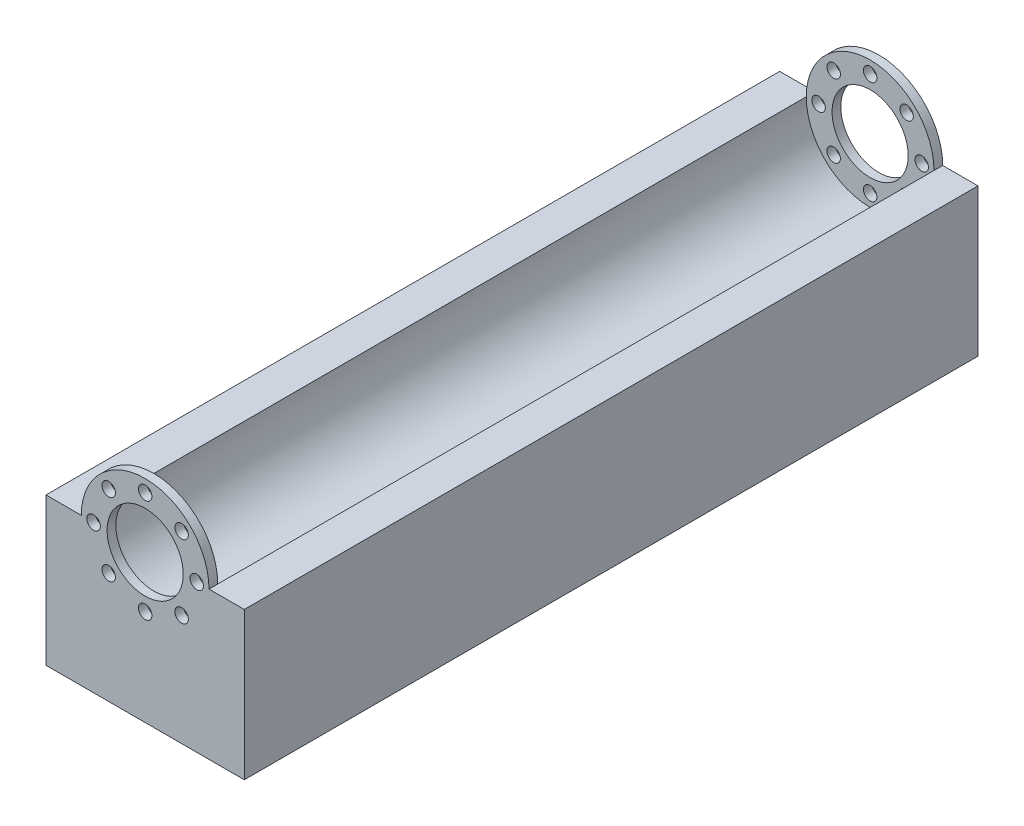
ISO-10303-21;
HEADER;
FILE_DESCRIPTION(('STEP AP214'),'2;1');
FILE_NAME('part.step','',(''),(''),'','','');
FILE_SCHEMA(('AUTOMOTIVE_DESIGN { 1 0 10303 214 1 1 1 1 }'));
ENDSEC;
DATA;
#1=APPLICATION_CONTEXT('core data for automotive mechanical design processes');
#2=APPLICATION_PROTOCOL_DEFINITION('international standard','automotive_design',2000,#1);
#3=PRODUCT_CONTEXT('',#1,'mechanical');
#4=PRODUCT('Part','Part','',(#3));
#5=PRODUCT_RELATED_PRODUCT_CATEGORY('part','',(#4));
#6=PRODUCT_DEFINITION_FORMATION('','',#4);
#7=PRODUCT_DEFINITION_CONTEXT('part definition',#1,'design');
#8=PRODUCT_DEFINITION('design','',#6,#7);
#9=PRODUCT_DEFINITION_SHAPE('','',#8);
#10=(LENGTH_UNIT() NAMED_UNIT(*) SI_UNIT(.MILLI.,.METRE.));
#11=(NAMED_UNIT(*) PLANE_ANGLE_UNIT() SI_UNIT($,.RADIAN.));
#12=(NAMED_UNIT(*) SI_UNIT($,.STERADIAN.) SOLID_ANGLE_UNIT());
#13=UNCERTAINTY_MEASURE_WITH_UNIT(LENGTH_MEASURE(1.E-05),#10,'distance_accuracy_value','');
#14=(GEOMETRIC_REPRESENTATION_CONTEXT(3) GLOBAL_UNCERTAINTY_ASSIGNED_CONTEXT((#13)) GLOBAL_UNIT_ASSIGNED_CONTEXT((#10,
#11,#12)) REPRESENTATION_CONTEXT('',''));
#15=CARTESIAN_POINT('',(0.,0.,0.));
#16=DIRECTION('',(0.,0.,1.));
#17=DIRECTION('',(1.,0.,0.));
#18=AXIS2_PLACEMENT_3D('',#15,#16,#17);
#19=CARTESIAN_POINT('',(0.,0.,92.5));
#20=DIRECTION('',(0.,0.,-1.));
#21=DIRECTION('',(-1.,0.,0.));
#22=AXIS2_PLACEMENT_3D('',#19,#20,#21);
#23=CYLINDRICAL_SURFACE('',#22,16.1);
#24=CARTESIAN_POINT('',(0.,0.,-90.3));
#25=DIRECTION('',(0.,0.,1.));
#26=DIRECTION('',(1.,0.,0.));
#27=AXIS2_PLACEMENT_3D('',#24,#25,#26);
#28=CIRCLE('',#27,16.1);
#29=CARTESIAN_POINT('',(-16.1,0.,-90.3));
#30=VERTEX_POINT('',#29);
#31=CARTESIAN_POINT('',(16.1,0.,-90.3));
#32=VERTEX_POINT('',#31);
#33=EDGE_CURVE('E53',#30,#32,#28,.T.);
#34=ORIENTED_EDGE('',*,*,#33,.F.);
#35=DIRECTION('',(0.,0.,-1.));
#36=VECTOR('',#35,1.);
#37=CARTESIAN_POINT('',(-16.1,0.,92.5));
#38=LINE('',#37,#36);
#39=CARTESIAN_POINT('',(-16.1,0.,90.3));
#40=VERTEX_POINT('',#39);
#41=EDGE_CURVE('E46',#40,#30,#38,.T.);
#42=ORIENTED_EDGE('',*,*,#41,.F.);
#43=CARTESIAN_POINT('',(0.,0.,90.3));
#44=DIRECTION('',(0.,0.,1.));
#45=DIRECTION('',(1.,0.,0.));
#46=AXIS2_PLACEMENT_3D('',#43,#44,#45);
#47=CIRCLE('',#46,16.1);
#48=CARTESIAN_POINT('',(16.1,0.,90.3));
#49=VERTEX_POINT('',#48);
#50=EDGE_CURVE('E194',#40,#49,#47,.T.);
#51=ORIENTED_EDGE('',*,*,#50,.T.);
#52=DIRECTION('',(0.,0.,-1.));
#53=VECTOR('',#52,1.);
#54=CARTESIAN_POINT('',(16.1,0.,92.5));
#55=LINE('',#54,#53);
#56=EDGE_CURVE('E207',#49,#32,#55,.T.);
#57=ORIENTED_EDGE('',*,*,#56,.T.);
#58=EDGE_LOOP('',(#34,#42,#51,#57));
#59=FACE_BOUND('',#58,.T.);
#60=ADVANCED_FACE('F39',(#59),#23,.F.);
#61=CARTESIAN_POINT('',(-25.,0.,92.5));
#62=DIRECTION('',(0.,-1.,0.));
#63=DIRECTION('',(0.,0.,-1.));
#64=AXIS2_PLACEMENT_3D('',#61,#62,#63);
#65=PLANE('',#64);
#66=DIRECTION('',(-1.,0.,0.));
#67=VECTOR('',#66,1.);
#68=CARTESIAN_POINT('',(-25.,0.,-92.5));
#69=LINE('',#68,#67);
#70=CARTESIAN_POINT('',(-16.1,0.,-92.5));
#71=VERTEX_POINT('',#70);
#72=CARTESIAN_POINT('',(-25.,0.,-92.5));
#73=VERTEX_POINT('',#72);
#74=EDGE_CURVE('E105',#71,#73,#69,.T.);
#75=ORIENTED_EDGE('',*,*,#74,.T.);
#76=DIRECTION('',(0.,0.,-1.));
#77=VECTOR('',#76,1.);
#78=CARTESIAN_POINT('',(-25.,0.,92.5));
#79=LINE('',#78,#77);
#80=CARTESIAN_POINT('',(-25.,0.,92.5));
#81=VERTEX_POINT('',#80);
#82=EDGE_CURVE('E225',#81,#73,#79,.T.);
#83=ORIENTED_EDGE('',*,*,#82,.F.);
#84=DIRECTION('',(-1.,0.,0.));
#85=VECTOR('',#84,1.);
#86=CARTESIAN_POINT('',(-25.,0.,92.5));
#87=LINE('',#86,#85);
#88=CARTESIAN_POINT('',(-16.1,0.,92.5));
#89=VERTEX_POINT('',#88);
#90=EDGE_CURVE('E196',#89,#81,#87,.T.);
#91=ORIENTED_EDGE('',*,*,#90,.F.);
#92=EDGE_CURVE('E11',#89,#40,#38,.T.);
#93=ORIENTED_EDGE('',*,*,#92,.T.);
#94=ORIENTED_EDGE('',*,*,#41,.T.);
#95=DIRECTION('',(0.,0.,-1.));
#96=VECTOR('',#95,1.);
#97=CARTESIAN_POINT('',(-16.1,0.,-90.3));
#98=LINE('',#97,#96);
#99=EDGE_CURVE('E120',#71,#30,#98,.F.);
#100=ORIENTED_EDGE('',*,*,#99,.F.);
#101=EDGE_LOOP('',(#75,#83,#91,#93,#94,#100));
#102=FACE_BOUND('',#101,.T.);
#103=ADVANCED_FACE('F121',(#102),#65,.F.);
#104=CARTESIAN_POINT('',(-25.,0.,92.5));
#105=DIRECTION('',(1.,0.,0.));
#106=DIRECTION('',(0.,0.,-1.));
#107=AXIS2_PLACEMENT_3D('',#104,#105,#106);
#108=PLANE('',#107);
#109=DIRECTION('',(0.,-1.,0.));
#110=VECTOR('',#109,1.);
#111=CARTESIAN_POINT('',(-25.,0.,-92.5));
#112=LINE('',#111,#110);
#113=CARTESIAN_POINT('',(-25.,-37.200306762793,-92.5));
#114=VERTEX_POINT('',#113);
#115=EDGE_CURVE('E113',#73,#114,#112,.T.);
#116=ORIENTED_EDGE('',*,*,#115,.T.);
#117=DIRECTION('',(0.,0.,-1.));
#118=VECTOR('',#117,1.);
#119=CARTESIAN_POINT('',(-25.,-37.200306762793,92.5));
#120=LINE('',#119,#118);
#121=CARTESIAN_POINT('',(-25.,-37.200306762793,92.5));
#122=VERTEX_POINT('',#121);
#123=EDGE_CURVE('E223',#122,#114,#120,.T.);
#124=ORIENTED_EDGE('',*,*,#123,.F.);
#125=DIRECTION('',(0.,-1.,0.));
#126=VECTOR('',#125,1.);
#127=CARTESIAN_POINT('',(-25.,0.,92.5));
#128=LINE('',#127,#126);
#129=EDGE_CURVE('E198',#81,#122,#128,.T.);
#130=ORIENTED_EDGE('',*,*,#129,.F.);
#131=ORIENTED_EDGE('',*,*,#82,.T.);
#132=EDGE_LOOP('',(#116,#124,#130,#131));
#133=FACE_BOUND('',#132,.T.);
#134=ADVANCED_FACE('F228',(#133),#108,.F.);
#135=CARTESIAN_POINT('',(-25.,-37.200306762793,92.5));
#136=DIRECTION('',(0.,1.,0.));
#137=DIRECTION('',(0.,0.,1.));
#138=AXIS2_PLACEMENT_3D('',#135,#136,#137);
#139=PLANE('',#138);
#140=DIRECTION('',(1.,0.,0.));
#141=VECTOR('',#140,1.);
#142=CARTESIAN_POINT('',(-25.,-37.200306762793,-92.5));
#143=LINE('',#142,#141);
#144=CARTESIAN_POINT('',(25.,-37.200306762793,-92.5));
#145=VERTEX_POINT('',#144);
#146=EDGE_CURVE('E210',#114,#145,#143,.T.);
#147=ORIENTED_EDGE('',*,*,#146,.T.);
#148=DIRECTION('',(0.,0.,-1.));
#149=VECTOR('',#148,1.);
#150=CARTESIAN_POINT('',(25.,-37.200306762793,92.5));
#151=LINE('',#150,#149);
#152=CARTESIAN_POINT('',(25.,-37.200306762793,92.5));
#153=VERTEX_POINT('',#152);
#154=EDGE_CURVE('E220',#153,#145,#151,.T.);
#155=ORIENTED_EDGE('',*,*,#154,.F.);
#156=DIRECTION('',(1.,0.,0.));
#157=VECTOR('',#156,1.);
#158=CARTESIAN_POINT('',(-25.,-37.200306762793,92.5));
#159=LINE('',#158,#157);
#160=EDGE_CURVE('E201',#122,#153,#159,.T.);
#161=ORIENTED_EDGE('',*,*,#160,.F.);
#162=ORIENTED_EDGE('',*,*,#123,.T.);
#163=EDGE_LOOP('',(#147,#155,#161,#162));
#164=FACE_BOUND('',#163,.T.);
#165=ADVANCED_FACE('F251',(#164),#139,.F.);
#166=CARTESIAN_POINT('',(25.,-37.200306762793,92.5));
#167=DIRECTION('',(-1.,0.,0.));
#168=DIRECTION('',(0.,0.,1.));
#169=AXIS2_PLACEMENT_3D('',#166,#167,#168);
#170=PLANE('',#169);
#171=DIRECTION('',(0.,1.,0.));
#172=VECTOR('',#171,1.);
#173=CARTESIAN_POINT('',(25.,-37.200306762793,-92.5));
#174=LINE('',#173,#172);
#175=CARTESIAN_POINT('',(25.,0.,-92.5));
#176=VERTEX_POINT('',#175);
#177=EDGE_CURVE('E212',#145,#176,#174,.T.);
#178=ORIENTED_EDGE('',*,*,#177,.T.);
#179=DIRECTION('',(0.,0.,-1.));
#180=VECTOR('',#179,1.);
#181=CARTESIAN_POINT('',(25.,0.,92.5));
#182=LINE('',#181,#180);
#183=CARTESIAN_POINT('',(25.,0.,92.5));
#184=VERTEX_POINT('',#183);
#185=EDGE_CURVE('E217',#184,#176,#182,.T.);
#186=ORIENTED_EDGE('',*,*,#185,.F.);
#187=DIRECTION('',(0.,1.,0.));
#188=VECTOR('',#187,1.);
#189=CARTESIAN_POINT('',(25.,-37.200306762793,92.5));
#190=LINE('',#189,#188);
#191=EDGE_CURVE('E203',#153,#184,#190,.T.);
#192=ORIENTED_EDGE('',*,*,#191,.F.);
#193=ORIENTED_EDGE('',*,*,#154,.T.);
#194=EDGE_LOOP('',(#178,#186,#192,#193));
#195=FACE_BOUND('',#194,.T.);
#196=ADVANCED_FACE('F247',(#195),#170,.F.);
#197=CARTESIAN_POINT('',(16.1,0.,92.5));
#198=DIRECTION('',(0.,-1.,0.));
#199=DIRECTION('',(1.,0.,0.));
#200=AXIS2_PLACEMENT_3D('',#197,#198,#199);
#201=PLANE('',#200);
#202=DIRECTION('',(-1.,0.,0.));
#203=VECTOR('',#202,1.);
#204=CARTESIAN_POINT('',(16.1,0.,-92.5));
#205=LINE('',#204,#203);
#206=CARTESIAN_POINT('',(16.1,0.,-92.5));
#207=VERTEX_POINT('',#206);
#208=EDGE_CURVE('E199',#176,#207,#205,.T.);
#209=ORIENTED_EDGE('',*,*,#208,.T.);
#210=DIRECTION('',(0.,0.,-1.));
#211=VECTOR('',#210,1.);
#212=CARTESIAN_POINT('',(16.1,0.,-90.3));
#213=LINE('',#212,#211);
#214=EDGE_CURVE('E61',#32,#207,#213,.T.);
#215=ORIENTED_EDGE('',*,*,#214,.F.);
#216=ORIENTED_EDGE('',*,*,#56,.F.);
#217=CARTESIAN_POINT('',(16.1,0.,92.5));
#218=VERTEX_POINT('',#217);
#219=EDGE_CURVE('E215',#218,#49,#55,.T.);
#220=ORIENTED_EDGE('',*,*,#219,.F.);
#221=DIRECTION('',(-1.,0.,0.));
#222=VECTOR('',#221,1.);
#223=CARTESIAN_POINT('',(16.1,0.,92.5));
#224=LINE('',#223,#222);
#225=EDGE_CURVE('E205',#184,#218,#224,.T.);
#226=ORIENTED_EDGE('',*,*,#225,.F.);
#227=ORIENTED_EDGE('',*,*,#185,.T.);
#228=EDGE_LOOP('',(#209,#215,#216,#220,#226,#227));
#229=FACE_BOUND('',#228,.T.);
#230=ADVANCED_FACE('F242',(#229),#201,.F.);
#231=CARTESIAN_POINT('',(0.,0.,92.5));
#232=DIRECTION('',(0.,0.,1.));
#233=DIRECTION('',(1.,0.,0.));
#234=AXIS2_PLACEMENT_3D('',#231,#232,#233);
#235=PLANE('',#234);
#236=ORIENTED_EDGE('',*,*,#225,.T.);
#237=CARTESIAN_POINT('',(0.,0.,92.5));
#238=DIRECTION('',(0.,0.,1.));
#239=DIRECTION('',(1.,0.,0.));
#240=AXIS2_PLACEMENT_3D('',#237,#238,#239);
#241=CIRCLE('',#240,16.1);
#242=EDGE_CURVE('E189',#218,#89,#241,.T.);
#243=ORIENTED_EDGE('',*,*,#242,.T.);
#244=ORIENTED_EDGE('',*,*,#90,.T.);
#245=ORIENTED_EDGE('',*,*,#129,.T.);
#246=ORIENTED_EDGE('',*,*,#160,.T.);
#247=ORIENTED_EDGE('',*,*,#191,.T.);
#248=EDGE_LOOP('',(#236,#243,#244,#245,#246,#247));
#249=FACE_BOUND('',#248,.T.);
#250=CARTESIAN_POINT('',(-9.19238815542501,9.19238815542523,92.5));
#251=DIRECTION('',(0.,0.,1.));
#252=DIRECTION('',(1.,0.,0.));
#253=AXIS2_PLACEMENT_3D('',#250,#251,#252);
#254=CIRCLE('',#253,1.7);
#255=CARTESIAN_POINT('',(-7.49238815542501,9.19238815542523,92.5));
#256=VERTEX_POINT('',#255);
#257=EDGE_CURVE('E125',#256,#256,#254,.T.);
#258=ORIENTED_EDGE('',*,*,#257,.F.);
#259=EDGE_LOOP('',(#258));
#260=FACE_BOUND('',#259,.T.);
#261=CARTESIAN_POINT('',(-13.,1.36048879186068E-13,92.5));
#262=DIRECTION('',(0.,0.,1.));
#263=DIRECTION('',(1.,0.,0.));
#264=AXIS2_PLACEMENT_3D('',#261,#262,#263);
#265=CIRCLE('',#264,1.7);
#266=CARTESIAN_POINT('',(-11.3,1.36048879186068E-13,92.5));
#267=VERTEX_POINT('',#266);
#268=EDGE_CURVE('E141',#267,#267,#265,.T.);
#269=ORIENTED_EDGE('',*,*,#268,.F.);
#270=EDGE_LOOP('',(#269));
#271=FACE_BOUND('',#270,.T.);
#272=CARTESIAN_POINT('',(-9.1923881554252,-9.19238815542504,92.5));
#273=DIRECTION('',(0.,0.,1.));
#274=DIRECTION('',(1.,0.,0.));
#275=AXIS2_PLACEMENT_3D('',#272,#273,#274);
#276=CIRCLE('',#275,1.7);
#277=CARTESIAN_POINT('',(-7.4923881554252,-9.19238815542504,92.5));
#278=VERTEX_POINT('',#277);
#279=EDGE_CURVE('E147',#278,#278,#276,.T.);
#280=ORIENTED_EDGE('',*,*,#279,.F.);
#281=EDGE_LOOP('',(#280));
#282=FACE_BOUND('',#281,.T.);
#283=CARTESIAN_POINT('',(0.,-13.,92.5));
#284=DIRECTION('',(0.,0.,1.));
#285=DIRECTION('',(1.,0.,0.));
#286=AXIS2_PLACEMENT_3D('',#283,#284,#285);
#287=CIRCLE('',#286,1.7);
#288=CARTESIAN_POINT('',(1.69999999999991,-13.,92.5));
#289=VERTEX_POINT('',#288);
#290=EDGE_CURVE('E153',#289,#289,#287,.T.);
#291=ORIENTED_EDGE('',*,*,#290,.F.);
#292=EDGE_LOOP('',(#291));
#293=FACE_BOUND('',#292,.T.);
#294=CARTESIAN_POINT('',(9.19238815542507,-9.19238815542517,92.5));
#295=DIRECTION('',(0.,0.,1.));
#296=DIRECTION('',(1.,0.,0.));
#297=AXIS2_PLACEMENT_3D('',#294,#295,#296);
#298=CIRCLE('',#297,1.7);
#299=CARTESIAN_POINT('',(10.8923881554251,-9.19238815542517,92.5));
#300=VERTEX_POINT('',#299);
#301=EDGE_CURVE('E159',#300,#300,#298,.T.);
#302=ORIENTED_EDGE('',*,*,#301,.F.);
#303=EDGE_LOOP('',(#302));
#304=FACE_BOUND('',#303,.T.);
#305=CARTESIAN_POINT('',(13.,0.,92.5));
#306=DIRECTION('',(0.,0.,1.));
#307=DIRECTION('',(1.,0.,0.));
#308=AXIS2_PLACEMENT_3D('',#305,#306,#307);
#309=CIRCLE('',#308,1.7);
#310=CARTESIAN_POINT('',(14.7,0.,92.5));
#311=VERTEX_POINT('',#310);
#312=EDGE_CURVE('E165',#311,#311,#309,.T.);
#313=ORIENTED_EDGE('',*,*,#312,.F.);
#314=EDGE_LOOP('',(#313));
#315=FACE_BOUND('',#314,.T.);
#316=CARTESIAN_POINT('',(9.19238815542513,9.1923881554251,92.5));
#317=DIRECTION('',(0.,0.,1.));
#318=DIRECTION('',(1.,0.,0.));
#319=AXIS2_PLACEMENT_3D('',#316,#317,#318);
#320=CIRCLE('',#319,1.7);
#321=CARTESIAN_POINT('',(10.8923881554251,9.1923881554251,92.5));
#322=VERTEX_POINT('',#321);
#323=EDGE_CURVE('E171',#322,#322,#320,.T.);
#324=ORIENTED_EDGE('',*,*,#323,.F.);
#325=EDGE_LOOP('',(#324));
#326=FACE_BOUND('',#325,.T.);
#327=CARTESIAN_POINT('',(0.,0.,92.5));
#328=DIRECTION('',(0.,0.,1.));
#329=DIRECTION('',(1.,0.,0.));
#330=AXIS2_PLACEMENT_3D('',#327,#328,#329);
#331=CIRCLE('',#330,9.6);
#332=CARTESIAN_POINT('',(9.6,0.,92.5));
#333=VERTEX_POINT('',#332);
#334=EDGE_CURVE('E177',#333,#333,#331,.T.);
#335=ORIENTED_EDGE('',*,*,#334,.F.);
#336=EDGE_LOOP('',(#335));
#337=FACE_BOUND('',#336,.T.);
#338=CARTESIAN_POINT('',(0.,13.,92.5));
#339=DIRECTION('',(0.,0.,1.));
#340=DIRECTION('',(1.,0.,0.));
#341=AXIS2_PLACEMENT_3D('',#338,#339,#340);
#342=CIRCLE('',#341,1.7);
#343=CARTESIAN_POINT('',(1.7,13.,92.5));
#344=VERTEX_POINT('',#343);
#345=EDGE_CURVE('E183',#344,#344,#342,.T.);
#346=ORIENTED_EDGE('',*,*,#345,.F.);
#347=EDGE_LOOP('',(#346));
#348=FACE_BOUND('',#347,.T.);
#349=ADVANCED_FACE('F233',(#249,#260,#271,#282,#293,#304,#315,#326,#337,#348),#235,.T.);
#350=CARTESIAN_POINT('',(0.,0.,-92.5));
#351=DIRECTION('',(0.,0.,1.));
#352=DIRECTION('',(1.,0.,0.));
#353=AXIS2_PLACEMENT_3D('',#350,#351,#352);
#354=PLANE('',#353);
#355=ORIENTED_EDGE('',*,*,#74,.F.);
#356=CARTESIAN_POINT('',(0.,0.,-92.5));
#357=DIRECTION('',(0.,0.,1.));
#358=DIRECTION('',(1.,0.,0.));
#359=AXIS2_PLACEMENT_3D('',#356,#357,#358);
#360=CIRCLE('',#359,16.1);
#361=EDGE_CURVE('E111',#207,#71,#360,.T.);
#362=ORIENTED_EDGE('',*,*,#361,.F.);
#363=ORIENTED_EDGE('',*,*,#208,.F.);
#364=ORIENTED_EDGE('',*,*,#177,.F.);
#365=ORIENTED_EDGE('',*,*,#146,.F.);
#366=ORIENTED_EDGE('',*,*,#115,.F.);
#367=EDGE_LOOP('',(#355,#362,#363,#364,#365,#366));
#368=FACE_BOUND('',#367,.T.);
#369=CARTESIAN_POINT('',(-13.,1.36048879186068E-13,-92.5));
#370=DIRECTION('',(0.,0.,1.));
#371=DIRECTION('',(1.,0.,0.));
#372=AXIS2_PLACEMENT_3D('',#369,#370,#371);
#373=CIRCLE('',#372,1.7);
#374=CARTESIAN_POINT('',(-11.3,1.36048879186068E-13,-92.5));
#375=VERTEX_POINT('',#374);
#376=EDGE_CURVE('E588',#375,#375,#373,.T.);
#377=ORIENTED_EDGE('',*,*,#376,.T.);
#378=EDGE_LOOP('',(#377));
#379=FACE_BOUND('',#378,.T.);
#380=CARTESIAN_POINT('',(0.,-13.,-92.5));
#381=DIRECTION('',(0.,0.,1.));
#382=DIRECTION('',(1.,0.,0.));
#383=AXIS2_PLACEMENT_3D('',#380,#381,#382);
#384=CIRCLE('',#383,1.7);
#385=CARTESIAN_POINT('',(1.69999999999991,-13.,-92.5));
#386=VERTEX_POINT('',#385);
#387=EDGE_CURVE('E600',#386,#386,#384,.T.);
#388=ORIENTED_EDGE('',*,*,#387,.T.);
#389=EDGE_LOOP('',(#388));
#390=FACE_BOUND('',#389,.T.);
#391=CARTESIAN_POINT('',(13.,0.,-92.5));
#392=DIRECTION('',(0.,0.,1.));
#393=DIRECTION('',(1.,0.,0.));
#394=AXIS2_PLACEMENT_3D('',#391,#392,#393);
#395=CIRCLE('',#394,1.7);
#396=CARTESIAN_POINT('',(14.7,0.,-92.5));
#397=VERTEX_POINT('',#396);
#398=EDGE_CURVE('E612',#397,#397,#395,.T.);
#399=ORIENTED_EDGE('',*,*,#398,.T.);
#400=EDGE_LOOP('',(#399));
#401=FACE_BOUND('',#400,.T.);
#402=CARTESIAN_POINT('',(0.,0.,-92.5));
#403=DIRECTION('',(0.,0.,1.));
#404=DIRECTION('',(1.,0.,0.));
#405=AXIS2_PLACEMENT_3D('',#402,#403,#404);
#406=CIRCLE('',#405,9.6);
#407=CARTESIAN_POINT('',(9.6,0.,-92.5));
#408=VERTEX_POINT('',#407);
#409=EDGE_CURVE('E624',#408,#408,#406,.T.);
#410=ORIENTED_EDGE('',*,*,#409,.T.);
#411=EDGE_LOOP('',(#410));
#412=FACE_BOUND('',#411,.T.);
#413=CARTESIAN_POINT('',(0.,13.,-92.5));
#414=DIRECTION('',(0.,0.,1.));
#415=DIRECTION('',(1.,0.,0.));
#416=AXIS2_PLACEMENT_3D('',#413,#414,#415);
#417=CIRCLE('',#416,1.7);
#418=CARTESIAN_POINT('',(1.7,13.,-92.5));
#419=VERTEX_POINT('',#418);
#420=EDGE_CURVE('E133',#419,#419,#417,.T.);
#421=ORIENTED_EDGE('',*,*,#420,.T.);
#422=EDGE_LOOP('',(#421));
#423=FACE_BOUND('',#422,.T.);
#424=CARTESIAN_POINT('',(9.19238815542513,9.1923881554251,-92.5));
#425=DIRECTION('',(0.,0.,1.));
#426=DIRECTION('',(1.,0.,0.));
#427=AXIS2_PLACEMENT_3D('',#424,#425,#426);
#428=CIRCLE('',#427,1.7);
#429=CARTESIAN_POINT('',(10.8923881554251,9.1923881554251,-92.5));
#430=VERTEX_POINT('',#429);
#431=EDGE_CURVE('E618',#430,#430,#428,.T.);
#432=ORIENTED_EDGE('',*,*,#431,.T.);
#433=EDGE_LOOP('',(#432));
#434=FACE_BOUND('',#433,.T.);
#435=CARTESIAN_POINT('',(9.19238815542507,-9.19238815542517,-92.5));
#436=DIRECTION('',(0.,0.,1.));
#437=DIRECTION('',(1.,0.,0.));
#438=AXIS2_PLACEMENT_3D('',#435,#436,#437);
#439=CIRCLE('',#438,1.7);
#440=CARTESIAN_POINT('',(10.8923881554251,-9.19238815542517,-92.5));
#441=VERTEX_POINT('',#440);
#442=EDGE_CURVE('E606',#441,#441,#439,.T.);
#443=ORIENTED_EDGE('',*,*,#442,.T.);
#444=EDGE_LOOP('',(#443));
#445=FACE_BOUND('',#444,.T.);
#446=CARTESIAN_POINT('',(-9.1923881554252,-9.19238815542504,-92.5));
#447=DIRECTION('',(0.,0.,1.));
#448=DIRECTION('',(1.,0.,0.));
#449=AXIS2_PLACEMENT_3D('',#446,#447,#448);
#450=CIRCLE('',#449,1.7);
#451=CARTESIAN_POINT('',(-7.4923881554252,-9.19238815542504,-92.5));
#452=VERTEX_POINT('',#451);
#453=EDGE_CURVE('E594',#452,#452,#450,.T.);
#454=ORIENTED_EDGE('',*,*,#453,.T.);
#455=EDGE_LOOP('',(#454));
#456=FACE_BOUND('',#455,.T.);
#457=CARTESIAN_POINT('',(-9.19238815542501,9.19238815542523,-92.5));
#458=DIRECTION('',(0.,0.,1.));
#459=DIRECTION('',(1.,0.,0.));
#460=AXIS2_PLACEMENT_3D('',#457,#458,#459);
#461=CIRCLE('',#460,1.7);
#462=CARTESIAN_POINT('',(-7.49238815542501,9.19238815542523,-92.5));
#463=VERTEX_POINT('',#462);
#464=EDGE_CURVE('E585',#463,#463,#461,.T.);
#465=ORIENTED_EDGE('',*,*,#464,.T.);
#466=EDGE_LOOP('',(#465));
#467=FACE_BOUND('',#466,.T.);
#468=ADVANCED_FACE('F107',(#368,#379,#390,#401,#412,#423,#434,#445,#456,#467),#354,.F.);
#469=CARTESIAN_POINT('',(0.,0.,90.3));
#470=DIRECTION('',(0.,0.,1.));
#471=DIRECTION('',(1.,0.,0.));
#472=AXIS2_PLACEMENT_3D('',#469,#470,#471);
#473=CYLINDRICAL_SURFACE('',#472,16.1);
#474=ORIENTED_EDGE('',*,*,#92,.F.);
#475=ORIENTED_EDGE('',*,*,#242,.F.);
#476=ORIENTED_EDGE('',*,*,#219,.T.);
#477=EDGE_CURVE('E117',#49,#40,#47,.T.);
#478=ORIENTED_EDGE('',*,*,#477,.T.);
#479=EDGE_LOOP('',(#474,#475,#476,#478));
#480=FACE_BOUND('',#479,.T.);
#481=ADVANCED_FACE('F238',(#480),#473,.T.);
#482=CARTESIAN_POINT('',(0.,0.,90.3));
#483=DIRECTION('',(0.,0.,1.));
#484=DIRECTION('',(1.,0.,0.));
#485=AXIS2_PLACEMENT_3D('',#482,#483,#484);
#486=PLANE('',#485);
#487=CARTESIAN_POINT('',(-9.19238815542501,9.19238815542523,90.3));
#488=DIRECTION('',(0.,0.,1.));
#489=DIRECTION('',(1.,0.,0.));
#490=AXIS2_PLACEMENT_3D('',#487,#488,#489);
#491=CIRCLE('',#490,1.7);
#492=CARTESIAN_POINT('',(-7.49238815542501,9.19238815542523,90.3));
#493=VERTEX_POINT('',#492);
#494=EDGE_CURVE('E138',#493,#493,#491,.T.);
#495=ORIENTED_EDGE('',*,*,#494,.T.);
#496=EDGE_LOOP('',(#495));
#497=FACE_BOUND('',#496,.T.);
#498=CARTESIAN_POINT('',(-13.,1.36048879186068E-13,90.3));
#499=DIRECTION('',(0.,0.,1.));
#500=DIRECTION('',(1.,0.,0.));
#501=AXIS2_PLACEMENT_3D('',#498,#499,#500);
#502=CIRCLE('',#501,1.7);
#503=CARTESIAN_POINT('',(-11.3,1.36048879186068E-13,90.3));
#504=VERTEX_POINT('',#503);
#505=EDGE_CURVE('E144',#504,#504,#502,.T.);
#506=ORIENTED_EDGE('',*,*,#505,.T.);
#507=EDGE_LOOP('',(#506));
#508=FACE_BOUND('',#507,.T.);
#509=CARTESIAN_POINT('',(-9.1923881554252,-9.19238815542504,90.3));
#510=DIRECTION('',(0.,0.,1.));
#511=DIRECTION('',(1.,0.,0.));
#512=AXIS2_PLACEMENT_3D('',#509,#510,#511);
#513=CIRCLE('',#512,1.7);
#514=CARTESIAN_POINT('',(-7.4923881554252,-9.19238815542504,90.3));
#515=VERTEX_POINT('',#514);
#516=EDGE_CURVE('E150',#515,#515,#513,.T.);
#517=ORIENTED_EDGE('',*,*,#516,.T.);
#518=EDGE_LOOP('',(#517));
#519=FACE_BOUND('',#518,.T.);
#520=CARTESIAN_POINT('',(0.,-13.,90.3));
#521=DIRECTION('',(0.,0.,1.));
#522=DIRECTION('',(1.,0.,0.));
#523=AXIS2_PLACEMENT_3D('',#520,#521,#522);
#524=CIRCLE('',#523,1.7);
#525=CARTESIAN_POINT('',(1.69999999999991,-13.,90.3));
#526=VERTEX_POINT('',#525);
#527=EDGE_CURVE('E156',#526,#526,#524,.T.);
#528=ORIENTED_EDGE('',*,*,#527,.T.);
#529=EDGE_LOOP('',(#528));
#530=FACE_BOUND('',#529,.T.);
#531=CARTESIAN_POINT('',(9.19238815542507,-9.19238815542517,90.3));
#532=DIRECTION('',(0.,0.,1.));
#533=DIRECTION('',(1.,0.,0.));
#534=AXIS2_PLACEMENT_3D('',#531,#532,#533);
#535=CIRCLE('',#534,1.7);
#536=CARTESIAN_POINT('',(10.8923881554251,-9.19238815542517,90.3));
#537=VERTEX_POINT('',#536);
#538=EDGE_CURVE('E162',#537,#537,#535,.T.);
#539=ORIENTED_EDGE('',*,*,#538,.T.);
#540=EDGE_LOOP('',(#539));
#541=FACE_BOUND('',#540,.T.);
#542=CARTESIAN_POINT('',(13.,0.,90.3));
#543=DIRECTION('',(0.,0.,1.));
#544=DIRECTION('',(1.,0.,0.));
#545=AXIS2_PLACEMENT_3D('',#542,#543,#544);
#546=CIRCLE('',#545,1.7);
#547=CARTESIAN_POINT('',(14.7,0.,90.3));
#548=VERTEX_POINT('',#547);
#549=EDGE_CURVE('E168',#548,#548,#546,.T.);
#550=ORIENTED_EDGE('',*,*,#549,.T.);
#551=EDGE_LOOP('',(#550));
#552=FACE_BOUND('',#551,.T.);
#553=CARTESIAN_POINT('',(9.19238815542513,9.1923881554251,90.3));
#554=DIRECTION('',(0.,0.,1.));
#555=DIRECTION('',(1.,0.,0.));
#556=AXIS2_PLACEMENT_3D('',#553,#554,#555);
#557=CIRCLE('',#556,1.7);
#558=CARTESIAN_POINT('',(10.8923881554251,9.1923881554251,90.3));
#559=VERTEX_POINT('',#558);
#560=EDGE_CURVE('E174',#559,#559,#557,.T.);
#561=ORIENTED_EDGE('',*,*,#560,.T.);
#562=EDGE_LOOP('',(#561));
#563=FACE_BOUND('',#562,.T.);
#564=CARTESIAN_POINT('',(0.,0.,90.3));
#565=DIRECTION('',(0.,0.,1.));
#566=DIRECTION('',(1.,0.,0.));
#567=AXIS2_PLACEMENT_3D('',#564,#565,#566);
#568=CIRCLE('',#567,9.6);
#569=CARTESIAN_POINT('',(9.6,0.,90.3));
#570=VERTEX_POINT('',#569);
#571=EDGE_CURVE('E180',#570,#570,#568,.T.);
#572=ORIENTED_EDGE('',*,*,#571,.T.);
#573=EDGE_LOOP('',(#572));
#574=FACE_BOUND('',#573,.T.);
#575=CARTESIAN_POINT('',(0.,13.,90.3));
#576=DIRECTION('',(0.,0.,1.));
#577=DIRECTION('',(1.,0.,0.));
#578=AXIS2_PLACEMENT_3D('',#575,#576,#577);
#579=CIRCLE('',#578,1.7);
#580=CARTESIAN_POINT('',(1.7,13.,90.3));
#581=VERTEX_POINT('',#580);
#582=EDGE_CURVE('E186',#581,#581,#579,.T.);
#583=ORIENTED_EDGE('',*,*,#582,.T.);
#584=EDGE_LOOP('',(#583));
#585=FACE_BOUND('',#584,.T.);
#586=ORIENTED_EDGE('',*,*,#477,.F.);
#587=ORIENTED_EDGE('',*,*,#50,.F.);
#588=EDGE_LOOP('',(#586,#587));
#589=FACE_BOUND('',#588,.T.);
#590=ADVANCED_FACE('F476',(#497,#508,#519,#530,#541,#552,#563,#574,#585,#589),#486,.F.);
#591=CARTESIAN_POINT('',(0.,13.,90.3));
#592=DIRECTION('',(0.,0.,1.));
#593=DIRECTION('',(1.,0.,0.));
#594=AXIS2_PLACEMENT_3D('',#591,#592,#593);
#595=CYLINDRICAL_SURFACE('',#594,1.7);
#596=ORIENTED_EDGE('',*,*,#582,.F.);
#597=EDGE_LOOP('',(#596));
#598=FACE_BOUND('',#597,.T.);
#599=ORIENTED_EDGE('',*,*,#345,.T.);
#600=EDGE_LOOP('',(#599));
#601=FACE_BOUND('',#600,.T.);
#602=ADVANCED_FACE('F467',(#598,#601),#595,.F.);
#603=CARTESIAN_POINT('',(0.,0.,90.3));
#604=DIRECTION('',(0.,0.,1.));
#605=DIRECTION('',(1.,0.,0.));
#606=AXIS2_PLACEMENT_3D('',#603,#604,#605);
#607=CYLINDRICAL_SURFACE('',#606,9.6);
#608=ORIENTED_EDGE('',*,*,#571,.F.);
#609=EDGE_LOOP('',(#608));
#610=FACE_BOUND('',#609,.T.);
#611=ORIENTED_EDGE('',*,*,#334,.T.);
#612=EDGE_LOOP('',(#611));
#613=FACE_BOUND('',#612,.T.);
#614=ADVANCED_FACE('F458',(#610,#613),#607,.F.);
#615=CARTESIAN_POINT('',(9.19238815542513,9.1923881554251,90.3));
#616=DIRECTION('',(0.,0.,1.));
#617=DIRECTION('',(1.,0.,0.));
#618=AXIS2_PLACEMENT_3D('',#615,#616,#617);
#619=CYLINDRICAL_SURFACE('',#618,1.7);
#620=ORIENTED_EDGE('',*,*,#560,.F.);
#621=EDGE_LOOP('',(#620));
#622=FACE_BOUND('',#621,.T.);
#623=ORIENTED_EDGE('',*,*,#323,.T.);
#624=EDGE_LOOP('',(#623));
#625=FACE_BOUND('',#624,.T.);
#626=ADVANCED_FACE('F449',(#622,#625),#619,.F.);
#627=CARTESIAN_POINT('',(13.,0.,90.3));
#628=DIRECTION('',(0.,0.,1.));
#629=DIRECTION('',(1.,0.,0.));
#630=AXIS2_PLACEMENT_3D('',#627,#628,#629);
#631=CYLINDRICAL_SURFACE('',#630,1.7);
#632=ORIENTED_EDGE('',*,*,#549,.F.);
#633=EDGE_LOOP('',(#632));
#634=FACE_BOUND('',#633,.T.);
#635=ORIENTED_EDGE('',*,*,#312,.T.);
#636=EDGE_LOOP('',(#635));
#637=FACE_BOUND('',#636,.T.);
#638=ADVANCED_FACE('F440',(#634,#637),#631,.F.);
#639=CARTESIAN_POINT('',(9.19238815542507,-9.19238815542517,90.3));
#640=DIRECTION('',(0.,0.,1.));
#641=DIRECTION('',(1.,0.,0.));
#642=AXIS2_PLACEMENT_3D('',#639,#640,#641);
#643=CYLINDRICAL_SURFACE('',#642,1.7);
#644=ORIENTED_EDGE('',*,*,#538,.F.);
#645=EDGE_LOOP('',(#644));
#646=FACE_BOUND('',#645,.T.);
#647=ORIENTED_EDGE('',*,*,#301,.T.);
#648=EDGE_LOOP('',(#647));
#649=FACE_BOUND('',#648,.T.);
#650=ADVANCED_FACE('F431',(#646,#649),#643,.F.);
#651=CARTESIAN_POINT('',(0.,-13.,90.3));
#652=DIRECTION('',(0.,0.,1.));
#653=DIRECTION('',(1.,0.,0.));
#654=AXIS2_PLACEMENT_3D('',#651,#652,#653);
#655=CYLINDRICAL_SURFACE('',#654,1.7);
#656=ORIENTED_EDGE('',*,*,#527,.F.);
#657=EDGE_LOOP('',(#656));
#658=FACE_BOUND('',#657,.T.);
#659=ORIENTED_EDGE('',*,*,#290,.T.);
#660=EDGE_LOOP('',(#659));
#661=FACE_BOUND('',#660,.T.);
#662=ADVANCED_FACE('F422',(#658,#661),#655,.F.);
#663=CARTESIAN_POINT('',(-9.1923881554252,-9.19238815542504,90.3));
#664=DIRECTION('',(0.,0.,1.));
#665=DIRECTION('',(1.,0.,0.));
#666=AXIS2_PLACEMENT_3D('',#663,#664,#665);
#667=CYLINDRICAL_SURFACE('',#666,1.7);
#668=ORIENTED_EDGE('',*,*,#516,.F.);
#669=EDGE_LOOP('',(#668));
#670=FACE_BOUND('',#669,.T.);
#671=ORIENTED_EDGE('',*,*,#279,.T.);
#672=EDGE_LOOP('',(#671));
#673=FACE_BOUND('',#672,.T.);
#674=ADVANCED_FACE('F413',(#670,#673),#667,.F.);
#675=CARTESIAN_POINT('',(-13.,1.36048879186068E-13,90.3));
#676=DIRECTION('',(0.,0.,1.));
#677=DIRECTION('',(1.,0.,0.));
#678=AXIS2_PLACEMENT_3D('',#675,#676,#677);
#679=CYLINDRICAL_SURFACE('',#678,1.7);
#680=ORIENTED_EDGE('',*,*,#505,.F.);
#681=EDGE_LOOP('',(#680));
#682=FACE_BOUND('',#681,.T.);
#683=ORIENTED_EDGE('',*,*,#268,.T.);
#684=EDGE_LOOP('',(#683));
#685=FACE_BOUND('',#684,.T.);
#686=ADVANCED_FACE('F404',(#682,#685),#679,.F.);
#687=CARTESIAN_POINT('',(-9.19238815542501,9.19238815542523,90.3));
#688=DIRECTION('',(0.,0.,1.));
#689=DIRECTION('',(1.,0.,0.));
#690=AXIS2_PLACEMENT_3D('',#687,#688,#689);
#691=CYLINDRICAL_SURFACE('',#690,1.7);
#692=ORIENTED_EDGE('',*,*,#494,.F.);
#693=EDGE_LOOP('',(#692));
#694=FACE_BOUND('',#693,.T.);
#695=ORIENTED_EDGE('',*,*,#257,.T.);
#696=EDGE_LOOP('',(#695));
#697=FACE_BOUND('',#696,.T.);
#698=ADVANCED_FACE('F292',(#694,#697),#691,.F.);
#699=CARTESIAN_POINT('',(0.,0.,-90.3));
#700=DIRECTION('',(0.,0.,-1.));
#701=DIRECTION('',(-1.,0.,0.));
#702=AXIS2_PLACEMENT_3D('',#699,#700,#701);
#703=CYLINDRICAL_SURFACE('',#702,16.1);
#704=ORIENTED_EDGE('',*,*,#361,.T.);
#705=ORIENTED_EDGE('',*,*,#99,.T.);
#706=EDGE_CURVE('E130',#32,#30,#28,.T.);
#707=ORIENTED_EDGE('',*,*,#706,.F.);
#708=ORIENTED_EDGE('',*,*,#214,.T.);
#709=EDGE_LOOP('',(#704,#705,#707,#708));
#710=FACE_BOUND('',#709,.T.);
#711=ADVANCED_FACE('F127',(#710),#703,.T.);
#712=CARTESIAN_POINT('',(0.,0.,-90.3));
#713=DIRECTION('',(0.,0.,-1.));
#714=DIRECTION('',(1.,0.,0.));
#715=AXIS2_PLACEMENT_3D('',#712,#713,#714);
#716=PLANE('',#715);
#717=ORIENTED_EDGE('',*,*,#706,.T.);
#718=ORIENTED_EDGE('',*,*,#33,.T.);
#719=EDGE_LOOP('',(#717,#718));
#720=FACE_BOUND('',#719,.T.);
#721=CARTESIAN_POINT('',(0.,13.,-90.3));
#722=DIRECTION('',(0.,0.,1.));
#723=DIRECTION('',(1.,0.,0.));
#724=AXIS2_PLACEMENT_3D('',#721,#722,#723);
#725=CIRCLE('',#724,1.7);
#726=CARTESIAN_POINT('',(1.7,13.,-90.3));
#727=VERTEX_POINT('',#726);
#728=EDGE_CURVE('E128',#727,#727,#725,.T.);
#729=ORIENTED_EDGE('',*,*,#728,.F.);
#730=EDGE_LOOP('',(#729));
#731=FACE_BOUND('',#730,.T.);
#732=CARTESIAN_POINT('',(0.,0.,-90.3));
#733=DIRECTION('',(0.,0.,1.));
#734=DIRECTION('',(1.,0.,0.));
#735=AXIS2_PLACEMENT_3D('',#732,#733,#734);
#736=CIRCLE('',#735,9.6);
#737=CARTESIAN_POINT('',(9.6,0.,-90.3));
#738=VERTEX_POINT('',#737);
#739=EDGE_CURVE('E627',#738,#738,#736,.T.);
#740=ORIENTED_EDGE('',*,*,#739,.F.);
#741=EDGE_LOOP('',(#740));
#742=FACE_BOUND('',#741,.T.);
#743=CARTESIAN_POINT('',(9.19238815542513,9.1923881554251,-90.3));
#744=DIRECTION('',(0.,0.,1.));
#745=DIRECTION('',(1.,0.,0.));
#746=AXIS2_PLACEMENT_3D('',#743,#744,#745);
#747=CIRCLE('',#746,1.7);
#748=CARTESIAN_POINT('',(10.8923881554251,9.1923881554251,-90.3));
#749=VERTEX_POINT('',#748);
#750=EDGE_CURVE('E621',#749,#749,#747,.T.);
#751=ORIENTED_EDGE('',*,*,#750,.F.);
#752=EDGE_LOOP('',(#751));
#753=FACE_BOUND('',#752,.T.);
#754=CARTESIAN_POINT('',(13.,0.,-90.3));
#755=DIRECTION('',(0.,0.,1.));
#756=DIRECTION('',(1.,0.,0.));
#757=AXIS2_PLACEMENT_3D('',#754,#755,#756);
#758=CIRCLE('',#757,1.7);
#759=CARTESIAN_POINT('',(14.7,0.,-90.3));
#760=VERTEX_POINT('',#759);
#761=EDGE_CURVE('E615',#760,#760,#758,.T.);
#762=ORIENTED_EDGE('',*,*,#761,.F.);
#763=EDGE_LOOP('',(#762));
#764=FACE_BOUND('',#763,.T.);
#765=CARTESIAN_POINT('',(9.19238815542507,-9.19238815542517,-90.3));
#766=DIRECTION('',(0.,0.,1.));
#767=DIRECTION('',(1.,0.,0.));
#768=AXIS2_PLACEMENT_3D('',#765,#766,#767);
#769=CIRCLE('',#768,1.7);
#770=CARTESIAN_POINT('',(10.8923881554251,-9.19238815542517,-90.3));
#771=VERTEX_POINT('',#770);
#772=EDGE_CURVE('E609',#771,#771,#769,.T.);
#773=ORIENTED_EDGE('',*,*,#772,.F.);
#774=EDGE_LOOP('',(#773));
#775=FACE_BOUND('',#774,.T.);
#776=CARTESIAN_POINT('',(0.,-13.,-90.3));
#777=DIRECTION('',(0.,0.,1.));
#778=DIRECTION('',(1.,0.,0.));
#779=AXIS2_PLACEMENT_3D('',#776,#777,#778);
#780=CIRCLE('',#779,1.7);
#781=CARTESIAN_POINT('',(1.69999999999991,-13.,-90.3));
#782=VERTEX_POINT('',#781);
#783=EDGE_CURVE('E603',#782,#782,#780,.T.);
#784=ORIENTED_EDGE('',*,*,#783,.F.);
#785=EDGE_LOOP('',(#784));
#786=FACE_BOUND('',#785,.T.);
#787=CARTESIAN_POINT('',(-9.1923881554252,-9.19238815542504,-90.3));
#788=DIRECTION('',(0.,0.,1.));
#789=DIRECTION('',(1.,0.,0.));
#790=AXIS2_PLACEMENT_3D('',#787,#788,#789);
#791=CIRCLE('',#790,1.7);
#792=CARTESIAN_POINT('',(-7.4923881554252,-9.19238815542504,-90.3));
#793=VERTEX_POINT('',#792);
#794=EDGE_CURVE('E597',#793,#793,#791,.T.);
#795=ORIENTED_EDGE('',*,*,#794,.F.);
#796=EDGE_LOOP('',(#795));
#797=FACE_BOUND('',#796,.T.);
#798=CARTESIAN_POINT('',(-13.,1.36048879186068E-13,-90.3));
#799=DIRECTION('',(0.,0.,1.));
#800=DIRECTION('',(1.,0.,0.));
#801=AXIS2_PLACEMENT_3D('',#798,#799,#800);
#802=CIRCLE('',#801,1.7);
#803=CARTESIAN_POINT('',(-11.3,1.36048879186068E-13,-90.3));
#804=VERTEX_POINT('',#803);
#805=EDGE_CURVE('E591',#804,#804,#802,.T.);
#806=ORIENTED_EDGE('',*,*,#805,.F.);
#807=EDGE_LOOP('',(#806));
#808=FACE_BOUND('',#807,.T.);
#809=CARTESIAN_POINT('',(-9.19238815542501,9.19238815542523,-90.3));
#810=DIRECTION('',(0.,0.,1.));
#811=DIRECTION('',(1.,0.,0.));
#812=AXIS2_PLACEMENT_3D('',#809,#810,#811);
#813=CIRCLE('',#812,1.7);
#814=CARTESIAN_POINT('',(-7.49238815542501,9.19238815542523,-90.3));
#815=VERTEX_POINT('',#814);
#816=EDGE_CURVE('E582',#815,#815,#813,.T.);
#817=ORIENTED_EDGE('',*,*,#816,.F.);
#818=EDGE_LOOP('',(#817));
#819=FACE_BOUND('',#818,.T.);
#820=ADVANCED_FACE('F291',(#720,#731,#742,#753,#764,#775,#786,#797,#808,#819),#716,.F.);
#821=CARTESIAN_POINT('',(0.,13.,-90.3));
#822=DIRECTION('',(0.,0.,-1.));
#823=DIRECTION('',(-1.,0.,0.));
#824=AXIS2_PLACEMENT_3D('',#821,#822,#823);
#825=CYLINDRICAL_SURFACE('',#824,1.7);
#826=ORIENTED_EDGE('',*,*,#728,.T.);
#827=EDGE_LOOP('',(#826));
#828=FACE_BOUND('',#827,.T.);
#829=ORIENTED_EDGE('',*,*,#420,.F.);
#830=EDGE_LOOP('',(#829));
#831=FACE_BOUND('',#830,.T.);
#832=ADVANCED_FACE('F300',(#828,#831),#825,.F.);
#833=CARTESIAN_POINT('',(0.,0.,-90.3));
#834=DIRECTION('',(0.,0.,-1.));
#835=DIRECTION('',(-1.,0.,0.));
#836=AXIS2_PLACEMENT_3D('',#833,#834,#835);
#837=CYLINDRICAL_SURFACE('',#836,9.6);
#838=ORIENTED_EDGE('',*,*,#739,.T.);
#839=EDGE_LOOP('',(#838));
#840=FACE_BOUND('',#839,.T.);
#841=ORIENTED_EDGE('',*,*,#409,.F.);
#842=EDGE_LOOP('',(#841));
#843=FACE_BOUND('',#842,.T.);
#844=ADVANCED_FACE('F309',(#840,#843),#837,.F.);
#845=CARTESIAN_POINT('',(9.19238815542513,9.1923881554251,-90.3));
#846=DIRECTION('',(0.,0.,-1.));
#847=DIRECTION('',(-1.,0.,0.));
#848=AXIS2_PLACEMENT_3D('',#845,#846,#847);
#849=CYLINDRICAL_SURFACE('',#848,1.7);
#850=ORIENTED_EDGE('',*,*,#750,.T.);
#851=EDGE_LOOP('',(#850));
#852=FACE_BOUND('',#851,.T.);
#853=ORIENTED_EDGE('',*,*,#431,.F.);
#854=EDGE_LOOP('',(#853));
#855=FACE_BOUND('',#854,.T.);
#856=ADVANCED_FACE('F318',(#852,#855),#849,.F.);
#857=CARTESIAN_POINT('',(13.,0.,-90.3));
#858=DIRECTION('',(0.,0.,-1.));
#859=DIRECTION('',(-1.,0.,0.));
#860=AXIS2_PLACEMENT_3D('',#857,#858,#859);
#861=CYLINDRICAL_SURFACE('',#860,1.7);
#862=ORIENTED_EDGE('',*,*,#761,.T.);
#863=EDGE_LOOP('',(#862));
#864=FACE_BOUND('',#863,.T.);
#865=ORIENTED_EDGE('',*,*,#398,.F.);
#866=EDGE_LOOP('',(#865));
#867=FACE_BOUND('',#866,.T.);
#868=ADVANCED_FACE('F327',(#864,#867),#861,.F.);
#869=CARTESIAN_POINT('',(9.19238815542507,-9.19238815542517,-90.3));
#870=DIRECTION('',(0.,0.,-1.));
#871=DIRECTION('',(-1.,0.,0.));
#872=AXIS2_PLACEMENT_3D('',#869,#870,#871);
#873=CYLINDRICAL_SURFACE('',#872,1.7);
#874=ORIENTED_EDGE('',*,*,#772,.T.);
#875=EDGE_LOOP('',(#874));
#876=FACE_BOUND('',#875,.T.);
#877=ORIENTED_EDGE('',*,*,#442,.F.);
#878=EDGE_LOOP('',(#877));
#879=FACE_BOUND('',#878,.T.);
#880=ADVANCED_FACE('F336',(#876,#879),#873,.F.);
#881=CARTESIAN_POINT('',(0.,-13.,-90.3));
#882=DIRECTION('',(0.,0.,-1.));
#883=DIRECTION('',(-1.,0.,0.));
#884=AXIS2_PLACEMENT_3D('',#881,#882,#883);
#885=CYLINDRICAL_SURFACE('',#884,1.7);
#886=ORIENTED_EDGE('',*,*,#783,.T.);
#887=EDGE_LOOP('',(#886));
#888=FACE_BOUND('',#887,.T.);
#889=ORIENTED_EDGE('',*,*,#387,.F.);
#890=EDGE_LOOP('',(#889));
#891=FACE_BOUND('',#890,.T.);
#892=ADVANCED_FACE('F345',(#888,#891),#885,.F.);
#893=CARTESIAN_POINT('',(-9.1923881554252,-9.19238815542504,-90.3));
#894=DIRECTION('',(0.,0.,-1.));
#895=DIRECTION('',(-1.,0.,0.));
#896=AXIS2_PLACEMENT_3D('',#893,#894,#895);
#897=CYLINDRICAL_SURFACE('',#896,1.7);
#898=ORIENTED_EDGE('',*,*,#794,.T.);
#899=EDGE_LOOP('',(#898));
#900=FACE_BOUND('',#899,.T.);
#901=ORIENTED_EDGE('',*,*,#453,.F.);
#902=EDGE_LOOP('',(#901));
#903=FACE_BOUND('',#902,.T.);
#904=ADVANCED_FACE('F354',(#900,#903),#897,.F.);
#905=CARTESIAN_POINT('',(-13.,1.36048879186068E-13,-90.3));
#906=DIRECTION('',(0.,0.,-1.));
#907=DIRECTION('',(-1.,0.,0.));
#908=AXIS2_PLACEMENT_3D('',#905,#906,#907);
#909=CYLINDRICAL_SURFACE('',#908,1.7);
#910=ORIENTED_EDGE('',*,*,#805,.T.);
#911=EDGE_LOOP('',(#910));
#912=FACE_BOUND('',#911,.T.);
#913=ORIENTED_EDGE('',*,*,#376,.F.);
#914=EDGE_LOOP('',(#913));
#915=FACE_BOUND('',#914,.T.);
#916=ADVANCED_FACE('F363',(#912,#915),#909,.F.);
#917=CARTESIAN_POINT('',(-9.19238815542501,9.19238815542523,-90.3));
#918=DIRECTION('',(0.,0.,-1.));
#919=DIRECTION('',(-1.,0.,0.));
#920=AXIS2_PLACEMENT_3D('',#917,#918,#919);
#921=CYLINDRICAL_SURFACE('',#920,1.7);
#922=ORIENTED_EDGE('',*,*,#816,.T.);
#923=EDGE_LOOP('',(#922));
#924=FACE_BOUND('',#923,.T.);
#925=ORIENTED_EDGE('',*,*,#464,.F.);
#926=EDGE_LOOP('',(#925));
#927=FACE_BOUND('',#926,.T.);
#928=ADVANCED_FACE('F372',(#924,#927),#921,.F.);
#929=CLOSED_SHELL('',(#60,#103,#134,#165,#196,#230,#349,#468,#481,#590,#602,#614,#626,#638,#650,
#662,#674,#686,#698,#711,#820,#832,#844,#856,#868,#880,#892,#904,#916,#928));
#930=MANIFOLD_SOLID_BREP('B2',#929);
#931=ADVANCED_BREP_SHAPE_REPRESENTATION('',(#18,#930),#14);
#932=SHAPE_DEFINITION_REPRESENTATION(#9,#931);
ENDSEC;
END-ISO-10303-21;
